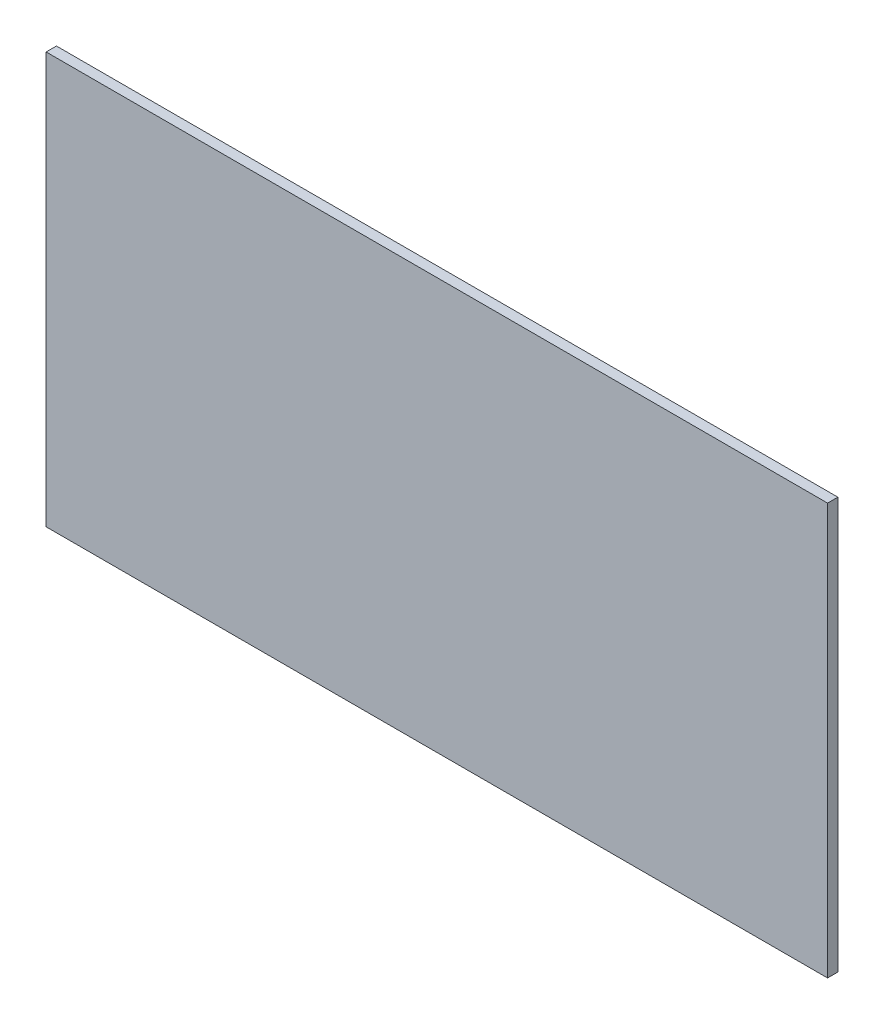
ISO-10303-21;
HEADER;
FILE_DESCRIPTION(('STEP AP214'),'2;1');
FILE_NAME('part.step','',(''),(''),'','','');
FILE_SCHEMA(('AUTOMOTIVE_DESIGN { 1 0 10303 214 1 1 1 1 }'));
ENDSEC;
DATA;
#1=APPLICATION_CONTEXT('core data for automotive mechanical design processes');
#2=APPLICATION_PROTOCOL_DEFINITION('international standard','automotive_design',2000,#1);
#3=PRODUCT_CONTEXT('',#1,'mechanical');
#4=PRODUCT('Part','Part','',(#3));
#5=PRODUCT_RELATED_PRODUCT_CATEGORY('part','',(#4));
#6=PRODUCT_DEFINITION_FORMATION('','',#4);
#7=PRODUCT_DEFINITION_CONTEXT('part definition',#1,'design');
#8=PRODUCT_DEFINITION('design','',#6,#7);
#9=PRODUCT_DEFINITION_SHAPE('','',#8);
#10=(LENGTH_UNIT() NAMED_UNIT(*) SI_UNIT(.MILLI.,.METRE.));
#11=(NAMED_UNIT(*) PLANE_ANGLE_UNIT() SI_UNIT($,.RADIAN.));
#12=(NAMED_UNIT(*) SI_UNIT($,.STERADIAN.) SOLID_ANGLE_UNIT());
#13=UNCERTAINTY_MEASURE_WITH_UNIT(LENGTH_MEASURE(1.E-05),#10,'distance_accuracy_value','');
#14=(GEOMETRIC_REPRESENTATION_CONTEXT(3) GLOBAL_UNCERTAINTY_ASSIGNED_CONTEXT((#13)) GLOBAL_UNIT_ASSIGNED_CONTEXT((#10,
#11,#12)) REPRESENTATION_CONTEXT('',''));
#15=CARTESIAN_POINT('',(0.,0.,0.));
#16=DIRECTION('',(0.,0.,1.));
#17=DIRECTION('',(1.,0.,0.));
#18=AXIS2_PLACEMENT_3D('',#15,#16,#17);
#19=CARTESIAN_POINT('',(241.3,0.,0.));
#20=DIRECTION('',(0.,0.,-1.));
#21=DIRECTION('',(-1.,0.,0.));
#22=AXIS2_PLACEMENT_3D('',#19,#20,#21);
#23=PLANE('',#22);
#24=DIRECTION('',(0.,-1.,0.));
#25=VECTOR('',#24,1.);
#26=CARTESIAN_POINT('',(0.,0.,0.));
#27=LINE('',#26,#25);
#28=CARTESIAN_POINT('',(0.,127.,0.));
#29=VERTEX_POINT('',#28);
#30=CARTESIAN_POINT('',(0.,0.,0.));
#31=VERTEX_POINT('',#30);
#32=EDGE_CURVE('E96',#29,#31,#27,.T.);
#33=ORIENTED_EDGE('',*,*,#32,.T.);
#34=DIRECTION('',(-1.,0.,0.));
#35=VECTOR('',#34,1.);
#36=CARTESIAN_POINT('',(241.3,0.,0.));
#37=LINE('',#36,#35);
#38=CARTESIAN_POINT('',(241.3,0.,0.));
#39=VERTEX_POINT('',#38);
#40=EDGE_CURVE('E11',#39,#31,#37,.T.);
#41=ORIENTED_EDGE('',*,*,#40,.F.);
#42=DIRECTION('',(0.,-1.,0.));
#43=VECTOR('',#42,1.);
#44=CARTESIAN_POINT('',(241.3,0.,0.));
#45=LINE('',#44,#43);
#46=CARTESIAN_POINT('',(241.3,127.,0.));
#47=VERTEX_POINT('',#46);
#48=EDGE_CURVE('E84',#47,#39,#45,.T.);
#49=ORIENTED_EDGE('',*,*,#48,.F.);
#50=DIRECTION('',(-1.,0.,0.));
#51=VECTOR('',#50,1.);
#52=CARTESIAN_POINT('',(241.3,127.,0.));
#53=LINE('',#52,#51);
#54=EDGE_CURVE('E92',#47,#29,#53,.T.);
#55=ORIENTED_EDGE('',*,*,#54,.T.);
#56=EDGE_LOOP('',(#33,#41,#49,#55));
#57=FACE_BOUND('',#56,.T.);
#58=ADVANCED_FACE('F33',(#57),#23,.F.);
#59=CARTESIAN_POINT('',(241.3,0.,0.));
#60=DIRECTION('',(0.,1.,0.));
#61=DIRECTION('',(0.,0.,1.));
#62=AXIS2_PLACEMENT_3D('',#59,#60,#61);
#63=PLANE('',#62);
#64=DIRECTION('',(0.,0.,-1.));
#65=VECTOR('',#64,1.);
#66=CARTESIAN_POINT('',(0.,0.,0.));
#67=LINE('',#66,#65);
#68=CARTESIAN_POINT('',(0.,0.,-3.175));
#69=VERTEX_POINT('',#68);
#70=EDGE_CURVE('E88',#31,#69,#67,.T.);
#71=ORIENTED_EDGE('',*,*,#70,.T.);
#72=DIRECTION('',(-1.,0.,0.));
#73=VECTOR('',#72,1.);
#74=CARTESIAN_POINT('',(241.3,0.,-3.175));
#75=LINE('',#74,#73);
#76=CARTESIAN_POINT('',(241.3,0.,-3.175));
#77=VERTEX_POINT('',#76);
#78=EDGE_CURVE('E41',#77,#69,#75,.T.);
#79=ORIENTED_EDGE('',*,*,#78,.F.);
#80=DIRECTION('',(0.,0.,-1.));
#81=VECTOR('',#80,1.);
#82=CARTESIAN_POINT('',(241.3,0.,0.));
#83=LINE('',#82,#81);
#84=EDGE_CURVE('E79',#39,#77,#83,.T.);
#85=ORIENTED_EDGE('',*,*,#84,.F.);
#86=ORIENTED_EDGE('',*,*,#40,.T.);
#87=EDGE_LOOP('',(#71,#79,#85,#86));
#88=FACE_BOUND('',#87,.T.);
#89=ADVANCED_FACE('F87',(#88),#63,.F.);
#90=CARTESIAN_POINT('',(241.3,0.,-3.175));
#91=DIRECTION('',(0.,0.,1.));
#92=DIRECTION('',(1.,0.,0.));
#93=AXIS2_PLACEMENT_3D('',#90,#91,#92);
#94=PLANE('',#93);
#95=DIRECTION('',(0.,1.,0.));
#96=VECTOR('',#95,1.);
#97=CARTESIAN_POINT('',(0.,0.,-3.175));
#98=LINE('',#97,#96);
#99=CARTESIAN_POINT('',(0.,127.,-3.175));
#100=VERTEX_POINT('',#99);
#101=EDGE_CURVE('E66',#69,#100,#98,.T.);
#102=ORIENTED_EDGE('',*,*,#101,.T.);
#103=DIRECTION('',(-1.,0.,0.));
#104=VECTOR('',#103,1.);
#105=CARTESIAN_POINT('',(241.3,127.,-3.175));
#106=LINE('',#105,#104);
#107=CARTESIAN_POINT('',(241.3,127.,-3.175));
#108=VERTEX_POINT('',#107);
#109=EDGE_CURVE('E89',#108,#100,#106,.T.);
#110=ORIENTED_EDGE('',*,*,#109,.F.);
#111=DIRECTION('',(0.,1.,0.));
#112=VECTOR('',#111,1.);
#113=CARTESIAN_POINT('',(241.3,0.,-3.175));
#114=LINE('',#113,#112);
#115=EDGE_CURVE('E82',#77,#108,#114,.T.);
#116=ORIENTED_EDGE('',*,*,#115,.F.);
#117=ORIENTED_EDGE('',*,*,#78,.T.);
#118=EDGE_LOOP('',(#102,#110,#116,#117));
#119=FACE_BOUND('',#118,.T.);
#120=ADVANCED_FACE('F90',(#119),#94,.F.);
#121=CARTESIAN_POINT('',(241.3,127.,0.));
#122=DIRECTION('',(0.,-1.,0.));
#123=DIRECTION('',(0.,0.,-1.));
#124=AXIS2_PLACEMENT_3D('',#121,#122,#123);
#125=PLANE('',#124);
#126=DIRECTION('',(0.,0.,1.));
#127=VECTOR('',#126,1.);
#128=CARTESIAN_POINT('',(0.,127.,0.));
#129=LINE('',#128,#127);
#130=EDGE_CURVE('E72',#100,#29,#129,.T.);
#131=ORIENTED_EDGE('',*,*,#130,.T.);
#132=ORIENTED_EDGE('',*,*,#54,.F.);
#133=DIRECTION('',(0.,0.,1.));
#134=VECTOR('',#133,1.);
#135=CARTESIAN_POINT('',(241.3,127.,0.));
#136=LINE('',#135,#134);
#137=EDGE_CURVE('E49',#108,#47,#136,.T.);
#138=ORIENTED_EDGE('',*,*,#137,.F.);
#139=ORIENTED_EDGE('',*,*,#109,.T.);
#140=EDGE_LOOP('',(#131,#132,#138,#139));
#141=FACE_BOUND('',#140,.T.);
#142=ADVANCED_FACE('F103',(#141),#125,.F.);
#143=CARTESIAN_POINT('',(241.3,0.,0.));
#144=DIRECTION('',(-1.,0.,0.));
#145=DIRECTION('',(0.,0.,1.));
#146=AXIS2_PLACEMENT_3D('',#143,#144,#145);
#147=PLANE('',#146);
#148=ORIENTED_EDGE('',*,*,#48,.T.);
#149=ORIENTED_EDGE('',*,*,#84,.T.);
#150=ORIENTED_EDGE('',*,*,#115,.T.);
#151=ORIENTED_EDGE('',*,*,#137,.T.);
#152=EDGE_LOOP('',(#148,#149,#150,#151));
#153=FACE_BOUND('',#152,.T.);
#154=ADVANCED_FACE('F80',(#153),#147,.F.);
#155=CARTESIAN_POINT('',(0.,0.,0.));
#156=DIRECTION('',(-1.,0.,0.));
#157=DIRECTION('',(0.,0.,1.));
#158=AXIS2_PLACEMENT_3D('',#155,#156,#157);
#159=PLANE('',#158);
#160=ORIENTED_EDGE('',*,*,#32,.F.);
#161=ORIENTED_EDGE('',*,*,#130,.F.);
#162=ORIENTED_EDGE('',*,*,#101,.F.);
#163=ORIENTED_EDGE('',*,*,#70,.F.);
#164=EDGE_LOOP('',(#160,#161,#162,#163));
#165=FACE_BOUND('',#164,.T.);
#166=ADVANCED_FACE('F106',(#165),#159,.T.);
#167=CLOSED_SHELL('',(#58,#89,#120,#142,#154,#166));
#168=MANIFOLD_SOLID_BREP('B2',#167);
#169=ADVANCED_BREP_SHAPE_REPRESENTATION('',(#18,#168),#14);
#170=SHAPE_DEFINITION_REPRESENTATION(#9,#169);
ENDSEC;
END-ISO-10303-21;
